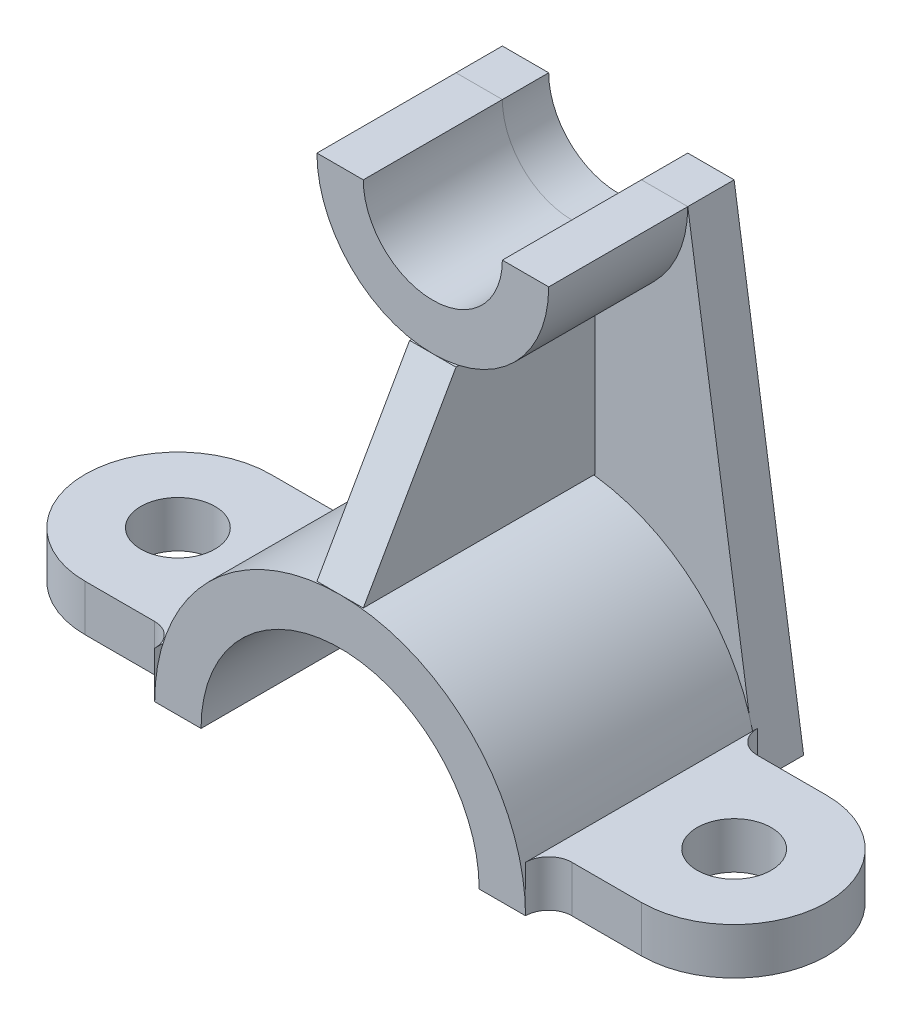
ISO-10303-21;
HEADER;
FILE_DESCRIPTION(('STEP AP214'),'2;1');
FILE_NAME('part.step','',(''),(''),'','','');
FILE_SCHEMA(('AUTOMOTIVE_DESIGN { 1 0 10303 214 1 1 1 1 }'));
ENDSEC;
DATA;
#1=APPLICATION_CONTEXT('core data for automotive mechanical design processes');
#2=APPLICATION_PROTOCOL_DEFINITION('international standard','automotive_design',2000,#1);
#3=PRODUCT_CONTEXT('',#1,'mechanical');
#4=PRODUCT('Part','Part','',(#3));
#5=PRODUCT_RELATED_PRODUCT_CATEGORY('part','',(#4));
#6=PRODUCT_DEFINITION_FORMATION('','',#4);
#7=PRODUCT_DEFINITION_CONTEXT('part definition',#1,'design');
#8=PRODUCT_DEFINITION('design','',#6,#7);
#9=PRODUCT_DEFINITION_SHAPE('','',#8);
#10=(LENGTH_UNIT() NAMED_UNIT(*) SI_UNIT(.MILLI.,.METRE.));
#11=(NAMED_UNIT(*) PLANE_ANGLE_UNIT() SI_UNIT($,.RADIAN.));
#12=(NAMED_UNIT(*) SI_UNIT($,.STERADIAN.) SOLID_ANGLE_UNIT());
#13=UNCERTAINTY_MEASURE_WITH_UNIT(LENGTH_MEASURE(1.E-05),#10,'distance_accuracy_value','');
#14=(GEOMETRIC_REPRESENTATION_CONTEXT(3) GLOBAL_UNCERTAINTY_ASSIGNED_CONTEXT((#13)) GLOBAL_UNIT_ASSIGNED_CONTEXT((#10,
#11,#12)) REPRESENTATION_CONTEXT('',''));
#15=CARTESIAN_POINT('',(0.,0.,0.));
#16=DIRECTION('',(0.,0.,1.));
#17=DIRECTION('',(1.,0.,0.));
#18=AXIS2_PLACEMENT_3D('',#15,#16,#17);
#19=CARTESIAN_POINT('',(-40.,10.,0.));
#20=DIRECTION('',(1.,0.,0.));
#21=DIRECTION('',(0.,0.,1.));
#22=AXIS2_PLACEMENT_3D('',#19,#20,#21);
#23=PLANE('',#22);
#24=DIRECTION('',(0.,0.,-1.));
#25=VECTOR('',#24,1.);
#26=CARTESIAN_POINT('',(-40.,0.,0.));
#27=LINE('',#26,#25);
#28=CARTESIAN_POINT('',(-40.,0.,0.));
#29=VERTEX_POINT('',#28);
#30=CARTESIAN_POINT('',(-40.,0.,-50.));
#31=VERTEX_POINT('',#30);
#32=EDGE_CURVE('E132',#29,#31,#27,.T.);
#33=ORIENTED_EDGE('',*,*,#32,.T.);
#34=DIRECTION('',(0.,-1.,0.));
#35=VECTOR('',#34,1.);
#36=CARTESIAN_POINT('',(-40.,10.,-50.));
#37=LINE('',#36,#35);
#38=CARTESIAN_POINT('',(-40.,10.,-50.));
#39=VERTEX_POINT('',#38);
#40=EDGE_CURVE('E131',#39,#31,#37,.T.);
#41=ORIENTED_EDGE('',*,*,#40,.F.);
#42=DIRECTION('',(0.,0.,-1.));
#43=VECTOR('',#42,1.);
#44=CARTESIAN_POINT('',(-40.,10.,0.));
#45=LINE('',#44,#43);
#46=CARTESIAN_POINT('',(-40.,10.,0.));
#47=VERTEX_POINT('',#46);
#48=EDGE_CURVE('E148',#47,#39,#45,.T.);
#49=ORIENTED_EDGE('',*,*,#48,.F.);
#50=DIRECTION('',(0.,-1.,0.));
#51=VECTOR('',#50,1.);
#52=CARTESIAN_POINT('',(-40.,10.,0.));
#53=LINE('',#52,#51);
#54=EDGE_CURVE('E12',#47,#29,#53,.T.);
#55=ORIENTED_EDGE('',*,*,#54,.T.);
#56=EDGE_LOOP('',(#33,#41,#49,#55));
#57=FACE_BOUND('',#56,.T.);
#58=ADVANCED_FACE('F45',(#57),#23,.T.);
#59=CARTESIAN_POINT('',(-45.,10.,0.));
#60=DIRECTION('',(0.,-1.,0.));
#61=DIRECTION('',(0.,0.,-1.));
#62=AXIS2_PLACEMENT_3D('',#59,#60,#61);
#63=CYLINDRICAL_SURFACE('',#62,5.);
#64=CARTESIAN_POINT('',(-45.,0.,0.));
#65=DIRECTION('',(0.,-1.,0.));
#66=DIRECTION('',(0.,0.,1.));
#67=AXIS2_PLACEMENT_3D('',#64,#65,#66);
#68=CIRCLE('',#67,5.);
#69=CARTESIAN_POINT('',(-45.,0.,-5.));
#70=VERTEX_POINT('',#69);
#71=EDGE_CURVE('E135',#29,#70,#68,.F.);
#72=ORIENTED_EDGE('',*,*,#71,.F.);
#73=ORIENTED_EDGE('',*,*,#54,.F.);
#74=CARTESIAN_POINT('',(-45.,10.,0.));
#75=DIRECTION('',(0.,-1.,0.));
#76=DIRECTION('',(0.,0.,1.));
#77=AXIS2_PLACEMENT_3D('',#74,#75,#76);
#78=CIRCLE('',#77,5.);
#79=CARTESIAN_POINT('',(-45.,10.,-5.));
#80=VERTEX_POINT('',#79);
#81=EDGE_CURVE('E93',#47,#80,#78,.F.);
#82=ORIENTED_EDGE('',*,*,#81,.T.);
#83=DIRECTION('',(0.,-1.,0.));
#84=VECTOR('',#83,1.);
#85=CARTESIAN_POINT('',(-45.,10.,-5.));
#86=LINE('',#85,#84);
#87=EDGE_CURVE('E53',#80,#70,#86,.T.);
#88=ORIENTED_EDGE('',*,*,#87,.T.);
#89=EDGE_LOOP('',(#72,#73,#82,#88));
#90=FACE_BOUND('',#89,.T.);
#91=ADVANCED_FACE('F154',(#90),#63,.F.);
#92=CARTESIAN_POINT('',(0.,10.,-5.));
#93=DIRECTION('',(0.,0.,-1.));
#94=DIRECTION('',(1.,0.,0.));
#95=AXIS2_PLACEMENT_3D('',#92,#93,#94);
#96=PLANE('',#95);
#97=DIRECTION('',(-1.,0.,0.));
#98=VECTOR('',#97,1.);
#99=CARTESIAN_POINT('',(0.,0.,-5.));
#100=LINE('',#99,#98);
#101=CARTESIAN_POINT('',(-60.,0.,-5.));
#102=VERTEX_POINT('',#101);
#103=EDGE_CURVE('E138',#70,#102,#100,.T.);
#104=ORIENTED_EDGE('',*,*,#103,.F.);
#105=ORIENTED_EDGE('',*,*,#87,.F.);
#106=DIRECTION('',(-1.,0.,0.));
#107=VECTOR('',#106,1.);
#108=CARTESIAN_POINT('',(0.,10.,-5.));
#109=LINE('',#108,#107);
#110=CARTESIAN_POINT('',(-60.,10.,-5.));
#111=VERTEX_POINT('',#110);
#112=EDGE_CURVE('E122',#80,#111,#109,.T.);
#113=ORIENTED_EDGE('',*,*,#112,.T.);
#114=DIRECTION('',(0.,-1.,0.));
#115=VECTOR('',#114,1.);
#116=CARTESIAN_POINT('',(-60.,10.,-5.));
#117=LINE('',#116,#115);
#118=EDGE_CURVE('E116',#111,#102,#117,.T.);
#119=ORIENTED_EDGE('',*,*,#118,.T.);
#120=EDGE_LOOP('',(#104,#105,#113,#119));
#121=FACE_BOUND('',#120,.T.);
#122=ADVANCED_FACE('F177',(#121),#96,.F.);
#123=CARTESIAN_POINT('',(-60.,10.,-25.));
#124=DIRECTION('',(0.,-1.,0.));
#125=DIRECTION('',(0.,0.,-1.));
#126=AXIS2_PLACEMENT_3D('',#123,#124,#125);
#127=CYLINDRICAL_SURFACE('',#126,20.);
#128=CARTESIAN_POINT('',(-60.,0.,-25.));
#129=DIRECTION('',(0.,-1.,0.));
#130=DIRECTION('',(0.,0.,1.));
#131=AXIS2_PLACEMENT_3D('',#128,#129,#130);
#132=CIRCLE('',#131,20.);
#133=CARTESIAN_POINT('',(-60.,0.,-45.));
#134=VERTEX_POINT('',#133);
#135=EDGE_CURVE('E141',#102,#134,#132,.T.);
#136=ORIENTED_EDGE('',*,*,#135,.F.);
#137=ORIENTED_EDGE('',*,*,#118,.F.);
#138=CARTESIAN_POINT('',(-60.,10.,-25.));
#139=DIRECTION('',(0.,-1.,0.));
#140=DIRECTION('',(0.,0.,1.));
#141=AXIS2_PLACEMENT_3D('',#138,#139,#140);
#142=CIRCLE('',#141,20.);
#143=CARTESIAN_POINT('',(-60.,10.,-45.));
#144=VERTEX_POINT('',#143);
#145=EDGE_CURVE('E106',#111,#144,#142,.T.);
#146=ORIENTED_EDGE('',*,*,#145,.T.);
#147=DIRECTION('',(0.,-1.,0.));
#148=VECTOR('',#147,1.);
#149=CARTESIAN_POINT('',(-60.,10.,-45.));
#150=LINE('',#149,#148);
#151=EDGE_CURVE('E111',#144,#134,#150,.T.);
#152=ORIENTED_EDGE('',*,*,#151,.T.);
#153=EDGE_LOOP('',(#136,#137,#146,#152));
#154=FACE_BOUND('',#153,.T.);
#155=ADVANCED_FACE('F119',(#154),#127,.T.);
#156=CARTESIAN_POINT('',(0.,10.,-45.));
#157=DIRECTION('',(0.,0.,-1.));
#158=DIRECTION('',(1.,0.,0.));
#159=AXIS2_PLACEMENT_3D('',#156,#157,#158);
#160=PLANE('',#159);
#161=DIRECTION('',(-1.,0.,0.));
#162=VECTOR('',#161,1.);
#163=CARTESIAN_POINT('',(0.,0.,-45.));
#164=LINE('',#163,#162);
#165=CARTESIAN_POINT('',(-45.,0.,-45.));
#166=VERTEX_POINT('',#165);
#167=EDGE_CURVE('E113',#166,#134,#164,.T.);
#168=ORIENTED_EDGE('',*,*,#167,.T.);
#169=ORIENTED_EDGE('',*,*,#151,.F.);
#170=DIRECTION('',(-1.,0.,0.));
#171=VECTOR('',#170,1.);
#172=CARTESIAN_POINT('',(0.,10.,-45.));
#173=LINE('',#172,#171);
#174=CARTESIAN_POINT('',(-45.,10.,-45.));
#175=VERTEX_POINT('',#174);
#176=EDGE_CURVE('E101',#175,#144,#173,.T.);
#177=ORIENTED_EDGE('',*,*,#176,.F.);
#178=DIRECTION('',(0.,-1.,0.));
#179=VECTOR('',#178,1.);
#180=CARTESIAN_POINT('',(-45.,10.,-45.));
#181=LINE('',#180,#179);
#182=EDGE_CURVE('E117',#175,#166,#181,.T.);
#183=ORIENTED_EDGE('',*,*,#182,.T.);
#184=EDGE_LOOP('',(#168,#169,#177,#183));
#185=FACE_BOUND('',#184,.T.);
#186=ADVANCED_FACE('F112',(#185),#160,.T.);
#187=CARTESIAN_POINT('',(-45.,10.,-50.));
#188=DIRECTION('',(0.,-1.,0.));
#189=DIRECTION('',(0.,0.,-1.));
#190=AXIS2_PLACEMENT_3D('',#187,#188,#189);
#191=CYLINDRICAL_SURFACE('',#190,5.);
#192=CARTESIAN_POINT('',(-45.,0.,-50.));
#193=DIRECTION('',(0.,-1.,0.));
#194=DIRECTION('',(0.,0.,1.));
#195=AXIS2_PLACEMENT_3D('',#192,#193,#194);
#196=CIRCLE('',#195,5.);
#197=EDGE_CURVE('E81',#31,#166,#196,.T.);
#198=ORIENTED_EDGE('',*,*,#197,.T.);
#199=ORIENTED_EDGE('',*,*,#182,.F.);
#200=CARTESIAN_POINT('',(-45.,10.,-50.));
#201=DIRECTION('',(0.,-1.,0.));
#202=DIRECTION('',(0.,0.,1.));
#203=AXIS2_PLACEMENT_3D('',#200,#201,#202);
#204=CIRCLE('',#203,5.);
#205=EDGE_CURVE('E61',#39,#175,#204,.T.);
#206=ORIENTED_EDGE('',*,*,#205,.F.);
#207=ORIENTED_EDGE('',*,*,#40,.T.);
#208=EDGE_LOOP('',(#198,#199,#206,#207));
#209=FACE_BOUND('',#208,.T.);
#210=ADVANCED_FACE('F162',(#209),#191,.F.);
#211=CARTESIAN_POINT('',(-60.,10.,-25.));
#212=DIRECTION('',(0.,-1.,0.));
#213=DIRECTION('',(0.,0.,-1.));
#214=AXIS2_PLACEMENT_3D('',#211,#212,#213);
#215=CYLINDRICAL_SURFACE('',#214,8.00000000000001);
#216=CARTESIAN_POINT('',(-60.,10.,-25.));
#217=DIRECTION('',(0.,-1.,0.));
#218=DIRECTION('',(0.,0.,1.));
#219=AXIS2_PLACEMENT_3D('',#216,#217,#218);
#220=CIRCLE('',#219,8.00000000000001);
#221=CARTESIAN_POINT('',(-60.,10.,-17.));
#222=VERTEX_POINT('',#221);
#223=EDGE_CURVE('E128',#222,#222,#220,.T.);
#224=ORIENTED_EDGE('',*,*,#223,.F.);
#225=EDGE_LOOP('',(#224));
#226=FACE_BOUND('',#225,.T.);
#227=CARTESIAN_POINT('',(-60.,0.,-25.));
#228=DIRECTION('',(0.,-1.,0.));
#229=DIRECTION('',(0.,0.,1.));
#230=AXIS2_PLACEMENT_3D('',#227,#228,#229);
#231=CIRCLE('',#230,8.00000000000001);
#232=CARTESIAN_POINT('',(-60.,0.,-17.));
#233=VERTEX_POINT('',#232);
#234=EDGE_CURVE('E145',#233,#233,#231,.T.);
#235=ORIENTED_EDGE('',*,*,#234,.T.);
#236=EDGE_LOOP('',(#235));
#237=FACE_BOUND('',#236,.T.);
#238=ADVANCED_FACE('F164',(#226,#237),#215,.F.);
#239=CARTESIAN_POINT('',(0.,10.,0.));
#240=DIRECTION('',(0.,1.,0.));
#241=DIRECTION('',(0.,0.,1.));
#242=AXIS2_PLACEMENT_3D('',#239,#240,#241);
#243=PLANE('',#242);
#244=ORIENTED_EDGE('',*,*,#48,.T.);
#245=ORIENTED_EDGE('',*,*,#205,.T.);
#246=ORIENTED_EDGE('',*,*,#176,.T.);
#247=ORIENTED_EDGE('',*,*,#145,.F.);
#248=ORIENTED_EDGE('',*,*,#112,.F.);
#249=ORIENTED_EDGE('',*,*,#81,.F.);
#250=EDGE_LOOP('',(#244,#245,#246,#247,#248,#249));
#251=FACE_BOUND('',#250,.T.);
#252=ORIENTED_EDGE('',*,*,#223,.T.);
#253=EDGE_LOOP('',(#252));
#254=FACE_BOUND('',#253,.T.);
#255=ADVANCED_FACE('F103',(#251,#254),#243,.T.);
#256=CARTESIAN_POINT('',(0.,0.,0.));
#257=DIRECTION('',(0.,1.,0.));
#258=DIRECTION('',(0.,0.,1.));
#259=AXIS2_PLACEMENT_3D('',#256,#257,#258);
#260=PLANE('',#259);
#261=ORIENTED_EDGE('',*,*,#32,.F.);
#262=ORIENTED_EDGE('',*,*,#71,.T.);
#263=ORIENTED_EDGE('',*,*,#103,.T.);
#264=ORIENTED_EDGE('',*,*,#135,.T.);
#265=ORIENTED_EDGE('',*,*,#167,.F.);
#266=ORIENTED_EDGE('',*,*,#197,.F.);
#267=EDGE_LOOP('',(#261,#262,#263,#264,#265,#266));
#268=FACE_BOUND('',#267,.T.);
#269=ORIENTED_EDGE('',*,*,#234,.F.);
#270=EDGE_LOOP('',(#269));
#271=FACE_BOUND('',#270,.T.);
#272=ADVANCED_FACE('F156',(#268,#271),#260,.F.);
#273=CLOSED_SHELL('',(#58,#91,#122,#155,#186,#210,#238,#255,#272));
#274=MANIFOLD_SOLID_BREP('B2',#273);
#275=CARTESIAN_POINT('',(40.,10.,0.));
#276=DIRECTION('',(-1.,0.,0.));
#277=DIRECTION('',(0.,0.,1.));
#278=AXIS2_PLACEMENT_3D('',#275,#276,#277);
#279=PLANE('',#278);
#280=DIRECTION('',(0.,0.,-1.));
#281=VECTOR('',#280,1.);
#282=CARTESIAN_POINT('',(40.,0.,0.));
#283=LINE('',#282,#281);
#284=CARTESIAN_POINT('',(40.,0.,0.));
#285=VERTEX_POINT('',#284);
#286=CARTESIAN_POINT('',(40.,0.,-50.));
#287=VERTEX_POINT('',#286);
#288=EDGE_CURVE('E364',#285,#287,#283,.T.);
#289=ORIENTED_EDGE('',*,*,#288,.F.);
#290=DIRECTION('',(0.,-1.,0.));
#291=VECTOR('',#290,1.);
#292=CARTESIAN_POINT('',(40.,10.,0.));
#293=LINE('',#292,#291);
#294=CARTESIAN_POINT('',(40.,10.,0.));
#295=VERTEX_POINT('',#294);
#296=EDGE_CURVE('E43',#295,#285,#293,.T.);
#297=ORIENTED_EDGE('',*,*,#296,.F.);
#298=DIRECTION('',(0.,0.,-1.));
#299=VECTOR('',#298,1.);
#300=CARTESIAN_POINT('',(40.,10.,0.));
#301=LINE('',#300,#299);
#302=CARTESIAN_POINT('',(40.,10.,-50.));
#303=VERTEX_POINT('',#302);
#304=EDGE_CURVE('E379',#295,#303,#301,.T.);
#305=ORIENTED_EDGE('',*,*,#304,.T.);
#306=DIRECTION('',(0.,-1.,0.));
#307=VECTOR('',#306,1.);
#308=CARTESIAN_POINT('',(40.,10.,-50.));
#309=LINE('',#308,#307);
#310=EDGE_CURVE('E294',#303,#287,#309,.T.);
#311=ORIENTED_EDGE('',*,*,#310,.T.);
#312=EDGE_LOOP('',(#289,#297,#305,#311));
#313=FACE_BOUND('',#312,.T.);
#314=ADVANCED_FACE('F278',(#313),#279,.T.);
#315=CARTESIAN_POINT('',(45.,10.,0.));
#316=DIRECTION('',(0.,-1.,0.));
#317=DIRECTION('',(0.,0.,-1.));
#318=AXIS2_PLACEMENT_3D('',#315,#316,#317);
#319=CYLINDRICAL_SURFACE('',#318,5.);
#320=CARTESIAN_POINT('',(45.,0.,0.));
#321=DIRECTION('',(0.,1.,0.));
#322=DIRECTION('',(0.,0.,1.));
#323=AXIS2_PLACEMENT_3D('',#320,#321,#322);
#324=CIRCLE('',#323,5.);
#325=CARTESIAN_POINT('',(45.,0.,-5.));
#326=VERTEX_POINT('',#325);
#327=EDGE_CURVE('E366',#285,#326,#324,.F.);
#328=ORIENTED_EDGE('',*,*,#327,.T.);
#329=DIRECTION('',(0.,-1.,0.));
#330=VECTOR('',#329,1.);
#331=CARTESIAN_POINT('',(45.,10.,-5.));
#332=LINE('',#331,#330);
#333=CARTESIAN_POINT('',(45.,10.,-5.));
#334=VERTEX_POINT('',#333);
#335=EDGE_CURVE('E286',#334,#326,#332,.T.);
#336=ORIENTED_EDGE('',*,*,#335,.F.);
#337=CARTESIAN_POINT('',(45.,10.,0.));
#338=DIRECTION('',(0.,1.,0.));
#339=DIRECTION('',(0.,0.,1.));
#340=AXIS2_PLACEMENT_3D('',#337,#338,#339);
#341=CIRCLE('',#340,5.);
#342=EDGE_CURVE('E493',#295,#334,#341,.F.);
#343=ORIENTED_EDGE('',*,*,#342,.F.);
#344=ORIENTED_EDGE('',*,*,#296,.T.);
#345=EDGE_LOOP('',(#328,#336,#343,#344));
#346=FACE_BOUND('',#345,.T.);
#347=ADVANCED_FACE('F404',(#346),#319,.F.);
#348=CARTESIAN_POINT('',(0.,10.,-5.));
#349=DIRECTION('',(0.,0.,-1.));
#350=DIRECTION('',(-1.,0.,0.));
#351=AXIS2_PLACEMENT_3D('',#348,#349,#350);
#352=PLANE('',#351);
#353=DIRECTION('',(1.,0.,0.));
#354=VECTOR('',#353,1.);
#355=CARTESIAN_POINT('',(0.,0.,-5.));
#356=LINE('',#355,#354);
#357=CARTESIAN_POINT('',(60.,0.,-5.));
#358=VERTEX_POINT('',#357);
#359=EDGE_CURVE('E368',#326,#358,#356,.T.);
#360=ORIENTED_EDGE('',*,*,#359,.T.);
#361=DIRECTION('',(0.,-1.,0.));
#362=VECTOR('',#361,1.);
#363=CARTESIAN_POINT('',(60.,10.,-5.));
#364=LINE('',#363,#362);
#365=CARTESIAN_POINT('',(60.,10.,-5.));
#366=VERTEX_POINT('',#365);
#367=EDGE_CURVE('E353',#366,#358,#364,.T.);
#368=ORIENTED_EDGE('',*,*,#367,.F.);
#369=DIRECTION('',(1.,0.,0.));
#370=VECTOR('',#369,1.);
#371=CARTESIAN_POINT('',(0.,10.,-5.));
#372=LINE('',#371,#370);
#373=EDGE_CURVE('E341',#334,#366,#372,.T.);
#374=ORIENTED_EDGE('',*,*,#373,.F.);
#375=ORIENTED_EDGE('',*,*,#335,.T.);
#376=EDGE_LOOP('',(#360,#368,#374,#375));
#377=FACE_BOUND('',#376,.T.);
#378=ADVANCED_FACE('F386',(#377),#352,.F.);
#379=CARTESIAN_POINT('',(60.,10.,-25.));
#380=DIRECTION('',(0.,-1.,0.));
#381=DIRECTION('',(0.,0.,-1.));
#382=AXIS2_PLACEMENT_3D('',#379,#380,#381);
#383=CYLINDRICAL_SURFACE('',#382,20.);
#384=CARTESIAN_POINT('',(60.,0.,-25.));
#385=DIRECTION('',(0.,1.,0.));
#386=DIRECTION('',(0.,0.,1.));
#387=AXIS2_PLACEMENT_3D('',#384,#385,#386);
#388=CIRCLE('',#387,20.);
#389=CARTESIAN_POINT('',(60.,0.,-45.));
#390=VERTEX_POINT('',#389);
#391=EDGE_CURVE('E350',#358,#390,#388,.T.);
#392=ORIENTED_EDGE('',*,*,#391,.T.);
#393=DIRECTION('',(0.,-1.,0.));
#394=VECTOR('',#393,1.);
#395=CARTESIAN_POINT('',(60.,10.,-45.));
#396=LINE('',#395,#394);
#397=CARTESIAN_POINT('',(60.,10.,-45.));
#398=VERTEX_POINT('',#397);
#399=EDGE_CURVE('E347',#398,#390,#396,.T.);
#400=ORIENTED_EDGE('',*,*,#399,.F.);
#401=CARTESIAN_POINT('',(60.,10.,-25.));
#402=DIRECTION('',(0.,1.,0.));
#403=DIRECTION('',(0.,0.,1.));
#404=AXIS2_PLACEMENT_3D('',#401,#402,#403);
#405=CIRCLE('',#404,20.);
#406=EDGE_CURVE('E332',#366,#398,#405,.T.);
#407=ORIENTED_EDGE('',*,*,#406,.F.);
#408=ORIENTED_EDGE('',*,*,#367,.T.);
#409=EDGE_LOOP('',(#392,#400,#407,#408));
#410=FACE_BOUND('',#409,.T.);
#411=ADVANCED_FACE('F348',(#410),#383,.T.);
#412=CARTESIAN_POINT('',(0.,10.,-45.));
#413=DIRECTION('',(0.,0.,-1.));
#414=DIRECTION('',(-1.,0.,0.));
#415=AXIS2_PLACEMENT_3D('',#412,#413,#414);
#416=PLANE('',#415);
#417=DIRECTION('',(1.,0.,0.));
#418=VECTOR('',#417,1.);
#419=CARTESIAN_POINT('',(0.,0.,-45.));
#420=LINE('',#419,#418);
#421=CARTESIAN_POINT('',(45.,0.,-45.));
#422=VERTEX_POINT('',#421);
#423=EDGE_CURVE('E371',#422,#390,#420,.T.);
#424=ORIENTED_EDGE('',*,*,#423,.F.);
#425=DIRECTION('',(0.,-1.,0.));
#426=VECTOR('',#425,1.);
#427=CARTESIAN_POINT('',(45.,10.,-45.));
#428=LINE('',#427,#426);
#429=CARTESIAN_POINT('',(45.,10.,-45.));
#430=VERTEX_POINT('',#429);
#431=EDGE_CURVE('E313',#430,#422,#428,.T.);
#432=ORIENTED_EDGE('',*,*,#431,.F.);
#433=DIRECTION('',(1.,0.,0.));
#434=VECTOR('',#433,1.);
#435=CARTESIAN_POINT('',(0.,10.,-45.));
#436=LINE('',#435,#434);
#437=EDGE_CURVE('E339',#430,#398,#436,.T.);
#438=ORIENTED_EDGE('',*,*,#437,.T.);
#439=ORIENTED_EDGE('',*,*,#399,.T.);
#440=EDGE_LOOP('',(#424,#432,#438,#439));
#441=FACE_BOUND('',#440,.T.);
#442=ADVANCED_FACE('F355',(#441),#416,.T.);
#443=CARTESIAN_POINT('',(45.,10.,-50.));
#444=DIRECTION('',(0.,-1.,0.));
#445=DIRECTION('',(0.,0.,-1.));
#446=AXIS2_PLACEMENT_3D('',#443,#444,#445);
#447=CYLINDRICAL_SURFACE('',#446,5.);
#448=CARTESIAN_POINT('',(45.,0.,-50.));
#449=DIRECTION('',(0.,1.,0.));
#450=DIRECTION('',(0.,0.,1.));
#451=AXIS2_PLACEMENT_3D('',#448,#449,#450);
#452=CIRCLE('',#451,5.);
#453=EDGE_CURVE('E373',#287,#422,#452,.T.);
#454=ORIENTED_EDGE('',*,*,#453,.F.);
#455=ORIENTED_EDGE('',*,*,#310,.F.);
#456=CARTESIAN_POINT('',(45.,10.,-50.));
#457=DIRECTION('',(0.,1.,0.));
#458=DIRECTION('',(0.,0.,1.));
#459=AXIS2_PLACEMENT_3D('',#456,#457,#458);
#460=CIRCLE('',#459,5.);
#461=EDGE_CURVE('E356',#303,#430,#460,.T.);
#462=ORIENTED_EDGE('',*,*,#461,.T.);
#463=ORIENTED_EDGE('',*,*,#431,.T.);
#464=EDGE_LOOP('',(#454,#455,#462,#463));
#465=FACE_BOUND('',#464,.T.);
#466=ADVANCED_FACE('F392',(#465),#447,.F.);
#467=CARTESIAN_POINT('',(60.,10.,-25.));
#468=DIRECTION('',(0.,-1.,0.));
#469=DIRECTION('',(0.,0.,-1.));
#470=AXIS2_PLACEMENT_3D('',#467,#468,#469);
#471=CYLINDRICAL_SURFACE('',#470,8.00000000000001);
#472=CARTESIAN_POINT('',(60.,10.,-25.));
#473=DIRECTION('',(0.,1.,0.));
#474=DIRECTION('',(0.,0.,1.));
#475=AXIS2_PLACEMENT_3D('',#472,#473,#474);
#476=CIRCLE('',#475,8.00000000000001);
#477=CARTESIAN_POINT('',(60.,10.,-17.));
#478=VERTEX_POINT('',#477);
#479=EDGE_CURVE('E358',#478,#478,#476,.T.);
#480=ORIENTED_EDGE('',*,*,#479,.T.);
#481=EDGE_LOOP('',(#480));
#482=FACE_BOUND('',#481,.T.);
#483=CARTESIAN_POINT('',(60.,0.,-25.));
#484=DIRECTION('',(0.,1.,0.));
#485=DIRECTION('',(0.,0.,1.));
#486=AXIS2_PLACEMENT_3D('',#483,#484,#485);
#487=CIRCLE('',#486,8.00000000000001);
#488=CARTESIAN_POINT('',(60.,0.,-17.));
#489=VERTEX_POINT('',#488);
#490=EDGE_CURVE('E376',#489,#489,#487,.T.);
#491=ORIENTED_EDGE('',*,*,#490,.F.);
#492=EDGE_LOOP('',(#491));
#493=FACE_BOUND('',#492,.T.);
#494=ADVANCED_FACE('F394',(#482,#493),#471,.F.);
#495=CARTESIAN_POINT('',(0.,10.,0.));
#496=DIRECTION('',(0.,1.,0.));
#497=DIRECTION('',(0.,0.,1.));
#498=AXIS2_PLACEMENT_3D('',#495,#496,#497);
#499=PLANE('',#498);
#500=ORIENTED_EDGE('',*,*,#304,.F.);
#501=ORIENTED_EDGE('',*,*,#342,.T.);
#502=ORIENTED_EDGE('',*,*,#373,.T.);
#503=ORIENTED_EDGE('',*,*,#406,.T.);
#504=ORIENTED_EDGE('',*,*,#437,.F.);
#505=ORIENTED_EDGE('',*,*,#461,.F.);
#506=EDGE_LOOP('',(#500,#501,#502,#503,#504,#505));
#507=FACE_BOUND('',#506,.T.);
#508=ORIENTED_EDGE('',*,*,#479,.F.);
#509=EDGE_LOOP('',(#508));
#510=FACE_BOUND('',#509,.T.);
#511=ADVANCED_FACE('F335',(#507,#510),#499,.T.);
#512=CARTESIAN_POINT('',(0.,0.,0.));
#513=DIRECTION('',(0.,1.,0.));
#514=DIRECTION('',(0.,0.,1.));
#515=AXIS2_PLACEMENT_3D('',#512,#513,#514);
#516=PLANE('',#515);
#517=ORIENTED_EDGE('',*,*,#288,.T.);
#518=ORIENTED_EDGE('',*,*,#453,.T.);
#519=ORIENTED_EDGE('',*,*,#423,.T.);
#520=ORIENTED_EDGE('',*,*,#391,.F.);
#521=ORIENTED_EDGE('',*,*,#359,.F.);
#522=ORIENTED_EDGE('',*,*,#327,.F.);
#523=EDGE_LOOP('',(#517,#518,#519,#520,#521,#522));
#524=FACE_BOUND('',#523,.T.);
#525=ORIENTED_EDGE('',*,*,#490,.T.);
#526=EDGE_LOOP('',(#525));
#527=FACE_BOUND('',#526,.T.);
#528=ADVANCED_FACE('F390',(#524,#527),#516,.F.);
#529=CLOSED_SHELL('',(#314,#347,#378,#411,#442,#466,#494,#511,#528));
#530=MANIFOLD_SOLID_BREP('B6',#529);
#531=CARTESIAN_POINT('',(0.,100.,-50.));
#532=DIRECTION('',(0.,0.,1.));
#533=DIRECTION('',(0.,-1.,0.));
#534=AXIS2_PLACEMENT_3D('',#531,#532,#533);
#535=CYLINDRICAL_SURFACE('',#534,15.);
#536=CARTESIAN_POINT('',(0.,100.,-20.));
#537=DIRECTION('',(0.,0.,-1.));
#538=DIRECTION('',(0.,1.,0.));
#539=AXIS2_PLACEMENT_3D('',#536,#537,#538);
#540=CIRCLE('',#539,15.);
#541=CARTESIAN_POINT('',(15.,100.,-20.));
#542=VERTEX_POINT('',#541);
#543=CARTESIAN_POINT('',(-15.,100.,-20.));
#544=VERTEX_POINT('',#543);
#545=EDGE_CURVE('E575',#542,#544,#540,.T.);
#546=ORIENTED_EDGE('',*,*,#545,.F.);
#547=DIRECTION('',(0.,0.,1.));
#548=VECTOR('',#547,1.);
#549=CARTESIAN_POINT('',(15.,100.,-50.));
#550=LINE('',#549,#548);
#551=CARTESIAN_POINT('',(15.,100.,-50.));
#552=VERTEX_POINT('',#551);
#553=EDGE_CURVE('E276',#552,#542,#550,.T.);
#554=ORIENTED_EDGE('',*,*,#553,.F.);
#555=CARTESIAN_POINT('',(0.,100.,-50.));
#556=DIRECTION('',(0.,0.,-1.));
#557=DIRECTION('',(0.,1.,0.));
#558=AXIS2_PLACEMENT_3D('',#555,#556,#557);
#559=CIRCLE('',#558,15.);
#560=CARTESIAN_POINT('',(-15.,100.,-50.));
#561=VERTEX_POINT('',#560);
#562=EDGE_CURVE('E569',#552,#561,#559,.T.);
#563=ORIENTED_EDGE('',*,*,#562,.T.);
#564=DIRECTION('',(0.,0.,1.));
#565=VECTOR('',#564,1.);
#566=CARTESIAN_POINT('',(-15.,100.,-50.));
#567=LINE('',#566,#565);
#568=EDGE_CURVE('E527',#561,#544,#567,.T.);
#569=ORIENTED_EDGE('',*,*,#568,.T.);
#570=EDGE_LOOP('',(#546,#554,#563,#569));
#571=FACE_BOUND('',#570,.T.);
#572=ADVANCED_FACE('F511',(#571),#535,.F.);
#573=CARTESIAN_POINT('',(0.,100.,-50.));
#574=DIRECTION('',(0.,1.,0.));
#575=DIRECTION('',(0.,0.,1.));
#576=AXIS2_PLACEMENT_3D('',#573,#574,#575);
#577=PLANE('',#576);
#578=DIRECTION('',(-1.,0.,0.));
#579=VECTOR('',#578,1.);
#580=CARTESIAN_POINT('',(0.,100.,-20.));
#581=LINE('',#580,#579);
#582=CARTESIAN_POINT('',(25.,100.,-20.));
#583=VERTEX_POINT('',#582);
#584=EDGE_CURVE('E559',#583,#542,#581,.T.);
#585=ORIENTED_EDGE('',*,*,#584,.F.);
#586=DIRECTION('',(0.,0.,1.));
#587=VECTOR('',#586,1.);
#588=CARTESIAN_POINT('',(25.,100.,-50.));
#589=LINE('',#588,#587);
#590=CARTESIAN_POINT('',(25.,100.,-50.));
#591=VERTEX_POINT('',#590);
#592=EDGE_CURVE('E519',#591,#583,#589,.T.);
#593=ORIENTED_EDGE('',*,*,#592,.F.);
#594=DIRECTION('',(-1.,0.,0.));
#595=VECTOR('',#594,1.);
#596=CARTESIAN_POINT('',(0.,100.,-50.));
#597=LINE('',#596,#595);
#598=EDGE_CURVE('E557',#591,#552,#597,.T.);
#599=ORIENTED_EDGE('',*,*,#598,.T.);
#600=ORIENTED_EDGE('',*,*,#553,.T.);
#601=EDGE_LOOP('',(#585,#593,#599,#600));
#602=FACE_BOUND('',#601,.T.);
#603=ADVANCED_FACE('F555',(#602),#577,.T.);
#604=CARTESIAN_POINT('',(0.,100.,-50.));
#605=DIRECTION('',(0.,0.,1.));
#606=DIRECTION('',(0.,-1.,0.));
#607=AXIS2_PLACEMENT_3D('',#604,#605,#606);
#608=CYLINDRICAL_SURFACE('',#607,25.);
#609=CARTESIAN_POINT('',(0.,100.,-20.));
#610=DIRECTION('',(0.,0.,-1.));
#611=DIRECTION('',(0.,1.,0.));
#612=AXIS2_PLACEMENT_3D('',#609,#610,#611);
#613=CIRCLE('',#612,25.);
#614=CARTESIAN_POINT('',(-25.,100.,-20.));
#615=VERTEX_POINT('',#614);
#616=EDGE_CURVE('E578',#583,#615,#613,.T.);
#617=ORIENTED_EDGE('',*,*,#616,.T.);
#618=DIRECTION('',(0.,0.,1.));
#619=VECTOR('',#618,1.);
#620=CARTESIAN_POINT('',(-25.,100.,-50.));
#621=LINE('',#620,#619);
#622=CARTESIAN_POINT('',(-25.,100.,-50.));
#623=VERTEX_POINT('',#622);
#624=EDGE_CURVE('E541',#623,#615,#621,.T.);
#625=ORIENTED_EDGE('',*,*,#624,.F.);
#626=CARTESIAN_POINT('',(0.,100.,-50.));
#627=DIRECTION('',(0.,0.,-1.));
#628=DIRECTION('',(0.,1.,0.));
#629=AXIS2_PLACEMENT_3D('',#626,#627,#628);
#630=CIRCLE('',#629,25.);
#631=EDGE_CURVE('E562',#591,#623,#630,.T.);
#632=ORIENTED_EDGE('',*,*,#631,.F.);
#633=ORIENTED_EDGE('',*,*,#592,.T.);
#634=EDGE_LOOP('',(#617,#625,#632,#633));
#635=FACE_BOUND('',#634,.T.);
#636=ADVANCED_FACE('F563',(#635),#608,.T.);
#637=CARTESIAN_POINT('',(0.,100.,-50.));
#638=DIRECTION('',(0.,1.,0.));
#639=DIRECTION('',(0.,0.,1.));
#640=AXIS2_PLACEMENT_3D('',#637,#638,#639);
#641=PLANE('',#640);
#642=DIRECTION('',(-1.,0.,0.));
#643=VECTOR('',#642,1.);
#644=CARTESIAN_POINT('',(0.,100.,-20.));
#645=LINE('',#644,#643);
#646=EDGE_CURVE('E571',#544,#615,#645,.T.);
#647=ORIENTED_EDGE('',*,*,#646,.F.);
#648=ORIENTED_EDGE('',*,*,#568,.F.);
#649=DIRECTION('',(-1.,0.,0.));
#650=VECTOR('',#649,1.);
#651=CARTESIAN_POINT('',(0.,100.,-50.));
#652=LINE('',#651,#650);
#653=EDGE_CURVE('E566',#561,#623,#652,.T.);
#654=ORIENTED_EDGE('',*,*,#653,.T.);
#655=ORIENTED_EDGE('',*,*,#624,.T.);
#656=EDGE_LOOP('',(#647,#648,#654,#655));
#657=FACE_BOUND('',#656,.T.);
#658=ADVANCED_FACE('F585',(#657),#641,.T.);
#659=CARTESIAN_POINT('',(0.,0.,-50.));
#660=DIRECTION('',(0.,0.,-1.));
#661=DIRECTION('',(0.,1.,0.));
#662=AXIS2_PLACEMENT_3D('',#659,#660,#661);
#663=PLANE('',#662);
#664=ORIENTED_EDGE('',*,*,#562,.F.);
#665=ORIENTED_EDGE('',*,*,#598,.F.);
#666=ORIENTED_EDGE('',*,*,#631,.T.);
#667=ORIENTED_EDGE('',*,*,#653,.F.);
#668=EDGE_LOOP('',(#664,#665,#666,#667));
#669=FACE_BOUND('',#668,.T.);
#670=ADVANCED_FACE('F568',(#669),#663,.T.);
#671=CARTESIAN_POINT('',(0.,0.,-20.));
#672=DIRECTION('',(0.,0.,-1.));
#673=DIRECTION('',(0.,1.,0.));
#674=AXIS2_PLACEMENT_3D('',#671,#672,#673);
#675=PLANE('',#674);
#676=ORIENTED_EDGE('',*,*,#545,.T.);
#677=ORIENTED_EDGE('',*,*,#646,.T.);
#678=ORIENTED_EDGE('',*,*,#616,.F.);
#679=ORIENTED_EDGE('',*,*,#584,.T.);
#680=EDGE_LOOP('',(#676,#677,#678,#679));
#681=FACE_BOUND('',#680,.T.);
#682=ADVANCED_FACE('F584',(#681),#675,.F.);
#683=CLOSED_SHELL('',(#572,#603,#636,#658,#670,#682));
#684=MANIFOLD_SOLID_BREP('B37',#683);
#685=CARTESIAN_POINT('',(5.,40.,-50.));
#686=DIRECTION('',(0.,1.,0.));
#687=DIRECTION('',(0.,0.,1.));
#688=AXIS2_PLACEMENT_3D('',#685,#686,#687);
#689=PLANE('',#688);
#690=DIRECTION('',(0.,0.,-1.));
#691=VECTOR('',#690,1.);
#692=CARTESIAN_POINT('',(-5.,40.,-50.));
#693=LINE('',#692,#691);
#694=CARTESIAN_POINT('',(-5.,40.,0.));
#695=VERTEX_POINT('',#694);
#696=CARTESIAN_POINT('',(-5.,40.,-50.));
#697=VERTEX_POINT('',#696);
#698=EDGE_CURVE('E712',#695,#697,#693,.T.);
#699=ORIENTED_EDGE('',*,*,#698,.T.);
#700=DIRECTION('',(-1.,0.,0.));
#701=VECTOR('',#700,1.);
#702=CARTESIAN_POINT('',(5.,40.,-50.));
#703=LINE('',#702,#701);
#704=CARTESIAN_POINT('',(5.,40.,-50.));
#705=VERTEX_POINT('',#704);
#706=EDGE_CURVE('E509',#705,#697,#703,.T.);
#707=ORIENTED_EDGE('',*,*,#706,.F.);
#708=DIRECTION('',(0.,0.,-1.));
#709=VECTOR('',#708,1.);
#710=CARTESIAN_POINT('',(5.,40.,-50.));
#711=LINE('',#710,#709);
#712=CARTESIAN_POINT('',(5.,40.,0.));
#713=VERTEX_POINT('',#712);
#714=EDGE_CURVE('E700',#713,#705,#711,.T.);
#715=ORIENTED_EDGE('',*,*,#714,.F.);
#716=DIRECTION('',(-1.,0.,0.));
#717=VECTOR('',#716,1.);
#718=CARTESIAN_POINT('',(5.,40.,0.));
#719=LINE('',#718,#717);
#720=EDGE_CURVE('E708',#713,#695,#719,.T.);
#721=ORIENTED_EDGE('',*,*,#720,.T.);
#722=EDGE_LOOP('',(#699,#707,#715,#721));
#723=FACE_BOUND('',#722,.T.);
#724=ADVANCED_FACE('F649',(#723),#689,.F.);
#725=CARTESIAN_POINT('',(5.,75.,-50.));
#726=DIRECTION('',(0.,0.,1.));
#727=DIRECTION('',(0.,-1.,0.));
#728=AXIS2_PLACEMENT_3D('',#725,#726,#727);
#729=PLANE('',#728);
#730=DIRECTION('',(0.,1.,0.));
#731=VECTOR('',#730,1.);
#732=CARTESIAN_POINT('',(-5.,75.,-50.));
#733=LINE('',#732,#731);
#734=CARTESIAN_POINT('',(-5.,75.,-50.));
#735=VERTEX_POINT('',#734);
#736=EDGE_CURVE('E704',#697,#735,#733,.T.);
#737=ORIENTED_EDGE('',*,*,#736,.T.);
#738=DIRECTION('',(-1.,0.,0.));
#739=VECTOR('',#738,1.);
#740=CARTESIAN_POINT('',(5.,75.,-50.));
#741=LINE('',#740,#739);
#742=CARTESIAN_POINT('',(5.,75.,-50.));
#743=VERTEX_POINT('',#742);
#744=EDGE_CURVE('E657',#743,#735,#741,.T.);
#745=ORIENTED_EDGE('',*,*,#744,.F.);
#746=DIRECTION('',(0.,1.,0.));
#747=VECTOR('',#746,1.);
#748=CARTESIAN_POINT('',(5.,75.,-50.));
#749=LINE('',#748,#747);
#750=EDGE_CURVE('E695',#705,#743,#749,.T.);
#751=ORIENTED_EDGE('',*,*,#750,.F.);
#752=ORIENTED_EDGE('',*,*,#706,.T.);
#753=EDGE_LOOP('',(#737,#745,#751,#752));
#754=FACE_BOUND('',#753,.T.);
#755=ADVANCED_FACE('F703',(#754),#729,.F.);
#756=CARTESIAN_POINT('',(5.,75.,-20.));
#757=DIRECTION('',(0.,-1.,0.));
#758=DIRECTION('',(0.,0.,-1.));
#759=AXIS2_PLACEMENT_3D('',#756,#757,#758);
#760=PLANE('',#759);
#761=DIRECTION('',(0.,0.,1.));
#762=VECTOR('',#761,1.);
#763=CARTESIAN_POINT('',(-5.,75.,-20.));
#764=LINE('',#763,#762);
#765=CARTESIAN_POINT('',(-5.,75.,-20.));
#766=VERTEX_POINT('',#765);
#767=EDGE_CURVE('E682',#735,#766,#764,.T.);
#768=ORIENTED_EDGE('',*,*,#767,.T.);
#769=DIRECTION('',(-1.,0.,0.));
#770=VECTOR('',#769,1.);
#771=CARTESIAN_POINT('',(5.,75.,-20.));
#772=LINE('',#771,#770);
#773=CARTESIAN_POINT('',(5.,75.,-20.));
#774=VERTEX_POINT('',#773);
#775=EDGE_CURVE('E705',#774,#766,#772,.T.);
#776=ORIENTED_EDGE('',*,*,#775,.F.);
#777=DIRECTION('',(0.,0.,1.));
#778=VECTOR('',#777,1.);
#779=CARTESIAN_POINT('',(5.,75.,-20.));
#780=LINE('',#779,#778);
#781=EDGE_CURVE('E698',#743,#774,#780,.T.);
#782=ORIENTED_EDGE('',*,*,#781,.F.);
#783=ORIENTED_EDGE('',*,*,#744,.T.);
#784=EDGE_LOOP('',(#768,#776,#782,#783));
#785=FACE_BOUND('',#784,.T.);
#786=ADVANCED_FACE('F706',(#785),#760,.F.);
#787=CARTESIAN_POINT('',(5.,40.,0.));
#788=DIRECTION('',(0.,-0.496138938356834,-0.868243142124459));
#789=DIRECTION('',(0.,0.868243142124459,-0.496138938356834));
#790=AXIS2_PLACEMENT_3D('',#787,#788,#789);
#791=PLANE('',#790);
#792=DIRECTION('',(0.,-0.868243142124459,0.496138938356834));
#793=VECTOR('',#792,1.);
#794=CARTESIAN_POINT('',(-5.,40.,0.));
#795=LINE('',#794,#793);
#796=EDGE_CURVE('E688',#766,#695,#795,.T.);
#797=ORIENTED_EDGE('',*,*,#796,.T.);
#798=ORIENTED_EDGE('',*,*,#720,.F.);
#799=DIRECTION('',(0.,-0.868243142124459,0.496138938356834));
#800=VECTOR('',#799,1.);
#801=CARTESIAN_POINT('',(5.,40.,0.));
#802=LINE('',#801,#800);
#803=EDGE_CURVE('E665',#774,#713,#802,.T.);
#804=ORIENTED_EDGE('',*,*,#803,.F.);
#805=ORIENTED_EDGE('',*,*,#775,.T.);
#806=EDGE_LOOP('',(#797,#798,#804,#805));
#807=FACE_BOUND('',#806,.T.);
#808=ADVANCED_FACE('F719',(#807),#791,.F.);
#809=CARTESIAN_POINT('',(5.,0.,0.));
#810=DIRECTION('',(1.,0.,0.));
#811=DIRECTION('',(0.,0.,-1.));
#812=AXIS2_PLACEMENT_3D('',#809,#810,#811);
#813=PLANE('',#812);
#814=ORIENTED_EDGE('',*,*,#714,.T.);
#815=ORIENTED_EDGE('',*,*,#750,.T.);
#816=ORIENTED_EDGE('',*,*,#781,.T.);
#817=ORIENTED_EDGE('',*,*,#803,.T.);
#818=EDGE_LOOP('',(#814,#815,#816,#817));
#819=FACE_BOUND('',#818,.T.);
#820=ADVANCED_FACE('F696',(#819),#813,.T.);
#821=CARTESIAN_POINT('',(-5.,0.,0.));
#822=DIRECTION('',(1.,0.,0.));
#823=DIRECTION('',(0.,0.,-1.));
#824=AXIS2_PLACEMENT_3D('',#821,#822,#823);
#825=PLANE('',#824);
#826=ORIENTED_EDGE('',*,*,#698,.F.);
#827=ORIENTED_EDGE('',*,*,#796,.F.);
#828=ORIENTED_EDGE('',*,*,#767,.F.);
#829=ORIENTED_EDGE('',*,*,#736,.F.);
#830=EDGE_LOOP('',(#826,#827,#828,#829));
#831=FACE_BOUND('',#830,.T.);
#832=ADVANCED_FACE('F722',(#831),#825,.F.);
#833=CLOSED_SHELL('',(#724,#755,#786,#808,#820,#832));
#834=MANIFOLD_SOLID_BREP('B270',#833);
#835=CARTESIAN_POINT('',(0.,0.,-50.));
#836=DIRECTION('',(0.,0.,1.));
#837=DIRECTION('',(1.,0.,0.));
#838=AXIS2_PLACEMENT_3D('',#835,#836,#837);
#839=PLANE('',#838);
#840=DIRECTION('',(0.148340452930245,-0.988936352868298,0.));
#841=VECTOR('',#840,1.);
#842=CARTESIAN_POINT('',(39.119804400978,5.8679706601467,-50.));
#843=LINE('',#842,#841);
#844=CARTESIAN_POINT('',(38.239608801956,11.7359413202934,-50.));
#845=VERTEX_POINT('',#844);
#846=CARTESIAN_POINT('',(40.,0.,-50.));
#847=VERTEX_POINT('',#846);
#848=EDGE_CURVE('E781',#845,#847,#843,.T.);
#849=ORIENTED_EDGE('',*,*,#848,.F.);
#850=CARTESIAN_POINT('',(0.,0.,-50.));
#851=DIRECTION('',(0.,0.,1.));
#852=DIRECTION('',(1.,0.,0.));
#853=AXIS2_PLACEMENT_3D('',#850,#851,#852);
#854=CIRCLE('',#853,40.);
#855=EDGE_CURVE('E910',#847,#845,#854,.T.);
#856=ORIENTED_EDGE('',*,*,#855,.F.);
#857=EDGE_LOOP('',(#849,#856));
#858=FACE_BOUND('',#857,.T.);
#859=ADVANCED_FACE('F772',(#858),#839,.F.);
#860=CARTESIAN_POINT('',(0.,0.,-50.));
#861=DIRECTION('',(0.,0.,1.));
#862=DIRECTION('',(1.,0.,0.));
#863=AXIS2_PLACEMENT_3D('',#860,#861,#862);
#864=CYLINDRICAL_SURFACE('',#863,40.);
#865=CARTESIAN_POINT('',(0.,0.,0.));
#866=DIRECTION('',(0.,0.,1.));
#867=DIRECTION('',(1.,0.,0.));
#868=AXIS2_PLACEMENT_3D('',#865,#866,#867);
#869=CIRCLE('',#868,40.);
#870=CARTESIAN_POINT('',(40.,0.,0.));
#871=VERTEX_POINT('',#870);
#872=CARTESIAN_POINT('',(-40.,0.,0.));
#873=VERTEX_POINT('',#872);
#874=EDGE_CURVE('E898',#871,#873,#869,.T.);
#875=ORIENTED_EDGE('',*,*,#874,.F.);
#876=DIRECTION('',(0.,0.,1.));
#877=VECTOR('',#876,1.);
#878=CARTESIAN_POINT('',(40.,0.,-50.));
#879=LINE('',#878,#877);
#880=EDGE_CURVE('E924',#847,#871,#879,.T.);
#881=ORIENTED_EDGE('',*,*,#880,.F.);
#882=ORIENTED_EDGE('',*,*,#855,.T.);
#883=CARTESIAN_POINT('',(-38.239608801956,11.7359413202934,-50.));
#884=VERTEX_POINT('',#883);
#885=EDGE_CURVE('E912',#845,#884,#854,.T.);
#886=ORIENTED_EDGE('',*,*,#885,.T.);
#887=CARTESIAN_POINT('',(-40.,0.,-50.));
#888=VERTEX_POINT('',#887);
#889=EDGE_CURVE('E788',#884,#888,#854,.T.);
#890=ORIENTED_EDGE('',*,*,#889,.T.);
#891=DIRECTION('',(0.,0.,1.));
#892=VECTOR('',#891,1.);
#893=CARTESIAN_POINT('',(-40.,0.,-50.));
#894=LINE('',#893,#892);
#895=EDGE_CURVE('E776',#888,#873,#894,.T.);
#896=ORIENTED_EDGE('',*,*,#895,.T.);
#897=EDGE_LOOP('',(#875,#881,#882,#886,#890,#896));
#898=FACE_BOUND('',#897,.T.);
#899=ADVANCED_FACE('F774',(#898),#864,.T.);
#900=CARTESIAN_POINT('',(30.,0.,-50.));
#901=DIRECTION('',(0.,-1.,0.));
#902=DIRECTION('',(0.,0.,-1.));
#903=AXIS2_PLACEMENT_3D('',#900,#901,#902);
#904=PLANE('',#903);
#905=DIRECTION('',(1.,0.,0.));
#906=VECTOR('',#905,1.);
#907=CARTESIAN_POINT('',(30.,0.,0.));
#908=LINE('',#907,#906);
#909=CARTESIAN_POINT('',(30.,0.,0.));
#910=VERTEX_POINT('',#909);
#911=EDGE_CURVE('E921',#910,#871,#908,.T.);
#912=ORIENTED_EDGE('',*,*,#911,.F.);
#913=DIRECTION('',(0.,0.,1.));
#914=VECTOR('',#913,1.);
#915=CARTESIAN_POINT('',(30.,0.,-50.));
#916=LINE('',#915,#914);
#917=CARTESIAN_POINT('',(30.,0.,-60.));
#918=VERTEX_POINT('',#917);
#919=EDGE_CURVE('E926',#918,#910,#916,.T.);
#920=ORIENTED_EDGE('',*,*,#919,.F.);
#921=DIRECTION('',(-1.,0.,0.));
#922=VECTOR('',#921,1.);
#923=CARTESIAN_POINT('',(0.,0.,-60.));
#924=LINE('',#923,#922);
#925=CARTESIAN_POINT('',(40.,0.,-60.));
#926=VERTEX_POINT('',#925);
#927=EDGE_CURVE('E881',#926,#918,#924,.T.);
#928=ORIENTED_EDGE('',*,*,#927,.F.);
#929=DIRECTION('',(0.,0.,1.));
#930=VECTOR('',#929,1.);
#931=CARTESIAN_POINT('',(40.,0.,-60.));
#932=LINE('',#931,#930);
#933=EDGE_CURVE('E868',#926,#847,#932,.T.);
#934=ORIENTED_EDGE('',*,*,#933,.T.);
#935=ORIENTED_EDGE('',*,*,#880,.T.);
#936=EDGE_LOOP('',(#912,#920,#928,#934,#935));
#937=FACE_BOUND('',#936,.T.);
#938=ADVANCED_FACE('F936',(#937),#904,.T.);
#939=CARTESIAN_POINT('',(0.,0.,-50.));
#940=DIRECTION('',(0.,0.,1.));
#941=DIRECTION('',(1.,0.,0.));
#942=AXIS2_PLACEMENT_3D('',#939,#940,#941);
#943=CYLINDRICAL_SURFACE('',#942,30.);
#944=CARTESIAN_POINT('',(0.,0.,0.));
#945=DIRECTION('',(0.,0.,-1.));
#946=DIRECTION('',(1.,0.,0.));
#947=AXIS2_PLACEMENT_3D('',#944,#945,#946);
#948=CIRCLE('',#947,30.);
#949=CARTESIAN_POINT('',(-30.,0.,0.));
#950=VERTEX_POINT('',#949);
#951=EDGE_CURVE('E918',#950,#910,#948,.T.);
#952=ORIENTED_EDGE('',*,*,#951,.F.);
#953=DIRECTION('',(0.,0.,1.));
#954=VECTOR('',#953,1.);
#955=CARTESIAN_POINT('',(-30.,0.,-50.));
#956=LINE('',#955,#954);
#957=CARTESIAN_POINT('',(-30.,0.,-60.));
#958=VERTEX_POINT('',#957);
#959=EDGE_CURVE('E927',#958,#950,#956,.T.);
#960=ORIENTED_EDGE('',*,*,#959,.F.);
#961=CARTESIAN_POINT('',(0.,0.,-60.));
#962=DIRECTION('',(0.,0.,1.));
#963=DIRECTION('',(1.,0.,0.));
#964=AXIS2_PLACEMENT_3D('',#961,#962,#963);
#965=CIRCLE('',#964,30.);
#966=EDGE_CURVE('E858',#918,#958,#965,.T.);
#967=ORIENTED_EDGE('',*,*,#966,.F.);
#968=ORIENTED_EDGE('',*,*,#919,.T.);
#969=EDGE_LOOP('',(#952,#960,#967,#968));
#970=FACE_BOUND('',#969,.T.);
#971=ADVANCED_FACE('F958',(#970),#943,.F.);
#972=CARTESIAN_POINT('',(-40.,0.,-50.));
#973=DIRECTION('',(0.,-1.,0.));
#974=DIRECTION('',(0.,0.,-1.));
#975=AXIS2_PLACEMENT_3D('',#972,#973,#974);
#976=PLANE('',#975);
#977=DIRECTION('',(1.,0.,0.));
#978=VECTOR('',#977,1.);
#979=CARTESIAN_POINT('',(-40.,0.,0.));
#980=LINE('',#979,#978);
#981=EDGE_CURVE('E915',#873,#950,#980,.T.);
#982=ORIENTED_EDGE('',*,*,#981,.F.);
#983=ORIENTED_EDGE('',*,*,#895,.F.);
#984=DIRECTION('',(0.,0.,1.));
#985=VECTOR('',#984,1.);
#986=CARTESIAN_POINT('',(-40.,0.,-60.));
#987=LINE('',#986,#985);
#988=CARTESIAN_POINT('',(-40.,0.,-60.));
#989=VERTEX_POINT('',#988);
#990=EDGE_CURVE('E863',#989,#888,#987,.T.);
#991=ORIENTED_EDGE('',*,*,#990,.F.);
#992=DIRECTION('',(-1.,0.,0.));
#993=VECTOR('',#992,1.);
#994=CARTESIAN_POINT('',(0.,0.,-60.));
#995=LINE('',#994,#993);
#996=EDGE_CURVE('E851',#958,#989,#995,.T.);
#997=ORIENTED_EDGE('',*,*,#996,.F.);
#998=ORIENTED_EDGE('',*,*,#959,.T.);
#999=EDGE_LOOP('',(#982,#983,#991,#997,#998));
#1000=FACE_BOUND('',#999,.T.);
#1001=ADVANCED_FACE('F865',(#1000),#976,.T.);
#1002=ORIENTED_EDGE('',*,*,#889,.F.);
#1003=DIRECTION('',(-0.148340452930245,-0.988936352868298,0.));
#1004=VECTOR('',#1003,1.);
#1005=CARTESIAN_POINT('',(-39.119804400978,5.86797066014671,-50.));
#1006=LINE('',#1005,#1004);
#1007=EDGE_CURVE('E647',#884,#888,#1006,.T.);
#1008=ORIENTED_EDGE('',*,*,#1007,.T.);
#1009=EDGE_LOOP('',(#1002,#1008));
#1010=FACE_BOUND('',#1009,.T.);
#1011=ADVANCED_FACE('F950',(#1010),#839,.F.);
#1012=CARTESIAN_POINT('',(0.,0.,0.));
#1013=DIRECTION('',(0.,0.,1.));
#1014=DIRECTION('',(1.,0.,0.));
#1015=AXIS2_PLACEMENT_3D('',#1012,#1013,#1014);
#1016=PLANE('',#1015);
#1017=ORIENTED_EDGE('',*,*,#874,.T.);
#1018=ORIENTED_EDGE('',*,*,#981,.T.);
#1019=ORIENTED_EDGE('',*,*,#951,.T.);
#1020=ORIENTED_EDGE('',*,*,#911,.T.);
#1021=EDGE_LOOP('',(#1017,#1018,#1019,#1020));
#1022=FACE_BOUND('',#1021,.T.);
#1023=ADVANCED_FACE('F933',(#1022),#1016,.T.);
#1024=CARTESIAN_POINT('',(0.,0.,-50.));
#1025=DIRECTION('',(0.,0.,1.));
#1026=DIRECTION('',(1.,0.,0.));
#1027=AXIS2_PLACEMENT_3D('',#1024,#1025,#1026);
#1028=PLANE('',#1027);
#1029=ORIENTED_EDGE('',*,*,#885,.F.);
#1030=CARTESIAN_POINT('',(25.,100.,-50.));
#1031=VERTEX_POINT('',#1030);
#1032=EDGE_CURVE('E891',#1031,#845,#843,.T.);
#1033=ORIENTED_EDGE('',*,*,#1032,.F.);
#1034=DIRECTION('',(1.,0.,0.));
#1035=VECTOR('',#1034,1.);
#1036=CARTESIAN_POINT('',(0.,100.,-50.));
#1037=LINE('',#1036,#1035);
#1038=CARTESIAN_POINT('',(15.,100.,-50.));
#1039=VERTEX_POINT('',#1038);
#1040=EDGE_CURVE('E894',#1039,#1031,#1037,.T.);
#1041=ORIENTED_EDGE('',*,*,#1040,.F.);
#1042=CARTESIAN_POINT('',(0.,100.,-50.));
#1043=DIRECTION('',(0.,0.,1.));
#1044=DIRECTION('',(1.,0.,0.));
#1045=AXIS2_PLACEMENT_3D('',#1042,#1043,#1044);
#1046=CIRCLE('',#1045,15.);
#1047=CARTESIAN_POINT('',(-15.,100.,-50.));
#1048=VERTEX_POINT('',#1047);
#1049=EDGE_CURVE('E877',#1048,#1039,#1046,.T.);
#1050=ORIENTED_EDGE('',*,*,#1049,.F.);
#1051=DIRECTION('',(1.,0.,0.));
#1052=VECTOR('',#1051,1.);
#1053=CARTESIAN_POINT('',(-1.80411241501588E-12,100.,-50.));
#1054=LINE('',#1053,#1052);
#1055=CARTESIAN_POINT('',(-25.,99.9999999999998,-50.));
#1056=VERTEX_POINT('',#1055);
#1057=EDGE_CURVE('E875',#1056,#1048,#1054,.T.);
#1058=ORIENTED_EDGE('',*,*,#1057,.F.);
#1059=EDGE_CURVE('E783',#1056,#884,#1006,.T.);
#1060=ORIENTED_EDGE('',*,*,#1059,.T.);
#1061=EDGE_LOOP('',(#1029,#1033,#1041,#1050,#1058,#1060));
#1062=FACE_BOUND('',#1061,.T.);
#1063=ADVANCED_FACE('F947',(#1062),#1028,.T.);
#1064=CARTESIAN_POINT('',(-39.119804400978,5.86797066014671,-60.));
#1065=DIRECTION('',(-0.988936352868298,0.148340452930245,0.));
#1066=DIRECTION('',(-0.148340452930245,-0.988936352868298,0.));
#1067=AXIS2_PLACEMENT_3D('',#1064,#1065,#1066);
#1068=PLANE('',#1067);
#1069=ORIENTED_EDGE('',*,*,#1059,.F.);
#1070=DIRECTION('',(0.,0.,1.));
#1071=VECTOR('',#1070,1.);
#1072=CARTESIAN_POINT('',(-25.,99.9999999999998,-60.));
#1073=LINE('',#1072,#1071);
#1074=CARTESIAN_POINT('',(-25.,99.9999999999998,-60.));
#1075=VERTEX_POINT('',#1074);
#1076=EDGE_CURVE('E873',#1075,#1056,#1073,.T.);
#1077=ORIENTED_EDGE('',*,*,#1076,.F.);
#1078=DIRECTION('',(-0.148340452930245,-0.988936352868298,0.));
#1079=VECTOR('',#1078,1.);
#1080=CARTESIAN_POINT('',(-39.119804400978,5.86797066014671,-60.));
#1081=LINE('',#1080,#1079);
#1082=EDGE_CURVE('E855',#1075,#989,#1081,.T.);
#1083=ORIENTED_EDGE('',*,*,#1082,.T.);
#1084=ORIENTED_EDGE('',*,*,#990,.T.);
#1085=ORIENTED_EDGE('',*,*,#1007,.F.);
#1086=EDGE_LOOP('',(#1069,#1077,#1083,#1084,#1085));
#1087=FACE_BOUND('',#1086,.T.);
#1088=ADVANCED_FACE('F872',(#1087),#1068,.T.);
#1089=CARTESIAN_POINT('',(-1.80411241501588E-12,100.,-60.));
#1090=DIRECTION('',(0.,-1.,0.));
#1091=DIRECTION('',(1.,0.,0.));
#1092=AXIS2_PLACEMENT_3D('',#1089,#1090,#1091);
#1093=PLANE('',#1092);
#1094=ORIENTED_EDGE('',*,*,#1057,.T.);
#1095=DIRECTION('',(0.,0.,1.));
#1096=VECTOR('',#1095,1.);
#1097=CARTESIAN_POINT('',(-15.,100.,-60.));
#1098=LINE('',#1097,#1096);
#1099=CARTESIAN_POINT('',(-15.,100.,-60.));
#1100=VERTEX_POINT('',#1099);
#1101=EDGE_CURVE('E899',#1100,#1048,#1098,.T.);
#1102=ORIENTED_EDGE('',*,*,#1101,.F.);
#1103=DIRECTION('',(1.,0.,0.));
#1104=VECTOR('',#1103,1.);
#1105=CARTESIAN_POINT('',(-1.80411241501588E-12,100.,-60.));
#1106=LINE('',#1105,#1104);
#1107=EDGE_CURVE('E869',#1075,#1100,#1106,.T.);
#1108=ORIENTED_EDGE('',*,*,#1107,.F.);
#1109=ORIENTED_EDGE('',*,*,#1076,.T.);
#1110=EDGE_LOOP('',(#1094,#1102,#1108,#1109));
#1111=FACE_BOUND('',#1110,.T.);
#1112=ADVANCED_FACE('F1005',(#1111),#1093,.F.);
#1113=CARTESIAN_POINT('',(0.,100.,-60.));
#1114=DIRECTION('',(0.,0.,1.));
#1115=DIRECTION('',(1.,0.,0.));
#1116=AXIS2_PLACEMENT_3D('',#1113,#1114,#1115);
#1117=CYLINDRICAL_SURFACE('',#1116,15.);
#1118=ORIENTED_EDGE('',*,*,#1049,.T.);
#1119=DIRECTION('',(0.,0.,1.));
#1120=VECTOR('',#1119,1.);
#1121=CARTESIAN_POINT('',(15.,100.,-60.));
#1122=LINE('',#1121,#1120);
#1123=CARTESIAN_POINT('',(15.,100.,-60.));
#1124=VERTEX_POINT('',#1123);
#1125=EDGE_CURVE('E902',#1124,#1039,#1122,.T.);
#1126=ORIENTED_EDGE('',*,*,#1125,.F.);
#1127=CARTESIAN_POINT('',(0.,100.,-60.));
#1128=DIRECTION('',(0.,0.,1.));
#1129=DIRECTION('',(1.,0.,0.));
#1130=AXIS2_PLACEMENT_3D('',#1127,#1128,#1129);
#1131=CIRCLE('',#1130,15.);
#1132=EDGE_CURVE('E887',#1100,#1124,#1131,.T.);
#1133=ORIENTED_EDGE('',*,*,#1132,.F.);
#1134=ORIENTED_EDGE('',*,*,#1101,.T.);
#1135=EDGE_LOOP('',(#1118,#1126,#1133,#1134));
#1136=FACE_BOUND('',#1135,.T.);
#1137=ADVANCED_FACE('F1014',(#1136),#1117,.F.);
#1138=CARTESIAN_POINT('',(0.,100.,-60.));
#1139=DIRECTION('',(0.,-1.,0.));
#1140=DIRECTION('',(0.,0.,-1.));
#1141=AXIS2_PLACEMENT_3D('',#1138,#1139,#1140);
#1142=PLANE('',#1141);
#1143=ORIENTED_EDGE('',*,*,#1040,.T.);
#1144=DIRECTION('',(0.,0.,1.));
#1145=VECTOR('',#1144,1.);
#1146=CARTESIAN_POINT('',(25.,100.,-60.));
#1147=LINE('',#1146,#1145);
#1148=CARTESIAN_POINT('',(25.,100.,-60.));
#1149=VERTEX_POINT('',#1148);
#1150=EDGE_CURVE('E905',#1149,#1031,#1147,.T.);
#1151=ORIENTED_EDGE('',*,*,#1150,.F.);
#1152=DIRECTION('',(1.,0.,0.));
#1153=VECTOR('',#1152,1.);
#1154=CARTESIAN_POINT('',(0.,100.,-60.));
#1155=LINE('',#1154,#1153);
#1156=EDGE_CURVE('E885',#1124,#1149,#1155,.T.);
#1157=ORIENTED_EDGE('',*,*,#1156,.F.);
#1158=ORIENTED_EDGE('',*,*,#1125,.T.);
#1159=EDGE_LOOP('',(#1143,#1151,#1157,#1158));
#1160=FACE_BOUND('',#1159,.T.);
#1161=ADVANCED_FACE('F1024',(#1160),#1142,.F.);
#1162=CARTESIAN_POINT('',(39.119804400978,5.8679706601467,-60.));
#1163=DIRECTION('',(-0.988936352868298,-0.148340452930245,0.));
#1164=DIRECTION('',(0.148340452930245,-0.988936352868298,0.));
#1165=AXIS2_PLACEMENT_3D('',#1162,#1163,#1164);
#1166=PLANE('',#1165);
#1167=ORIENTED_EDGE('',*,*,#1032,.T.);
#1168=ORIENTED_EDGE('',*,*,#848,.T.);
#1169=ORIENTED_EDGE('',*,*,#933,.F.);
#1170=DIRECTION('',(0.148340452930245,-0.988936352868298,0.));
#1171=VECTOR('',#1170,1.);
#1172=CARTESIAN_POINT('',(39.119804400978,5.8679706601467,-60.));
#1173=LINE('',#1172,#1171);
#1174=EDGE_CURVE('E883',#1149,#926,#1173,.T.);
#1175=ORIENTED_EDGE('',*,*,#1174,.F.);
#1176=ORIENTED_EDGE('',*,*,#1150,.T.);
#1177=EDGE_LOOP('',(#1167,#1168,#1169,#1175,#1176));
#1178=FACE_BOUND('',#1177,.T.);
#1179=ADVANCED_FACE('F941',(#1178),#1166,.F.);
#1180=CARTESIAN_POINT('',(0.,0.,-60.));
#1181=DIRECTION('',(0.,0.,1.));
#1182=DIRECTION('',(1.,0.,0.));
#1183=AXIS2_PLACEMENT_3D('',#1180,#1181,#1182);
#1184=PLANE('',#1183);
#1185=ORIENTED_EDGE('',*,*,#1082,.F.);
#1186=ORIENTED_EDGE('',*,*,#1107,.T.);
#1187=ORIENTED_EDGE('',*,*,#1132,.T.);
#1188=ORIENTED_EDGE('',*,*,#1156,.T.);
#1189=ORIENTED_EDGE('',*,*,#1174,.T.);
#1190=ORIENTED_EDGE('',*,*,#927,.T.);
#1191=ORIENTED_EDGE('',*,*,#966,.T.);
#1192=ORIENTED_EDGE('',*,*,#996,.T.);
#1193=EDGE_LOOP('',(#1185,#1186,#1187,#1188,#1189,#1190,#1191,#1192));
#1194=FACE_BOUND('',#1193,.T.);
#1195=ADVANCED_FACE('F853',(#1194),#1184,.F.);
#1196=CLOSED_SHELL('',(#859,#899,#938,#971,#1001,#1011,#1023,#1063,#1088,#1112,#1137,#1161,
#1179,#1195));
#1197=MANIFOLD_SOLID_BREP('B503',#1196);
#1198=ADVANCED_BREP_SHAPE_REPRESENTATION('',(#18,#274,#530,#684,#834,#1197),#14);
#1199=SHAPE_DEFINITION_REPRESENTATION(#9,#1198);
ENDSEC;
END-ISO-10303-21;
